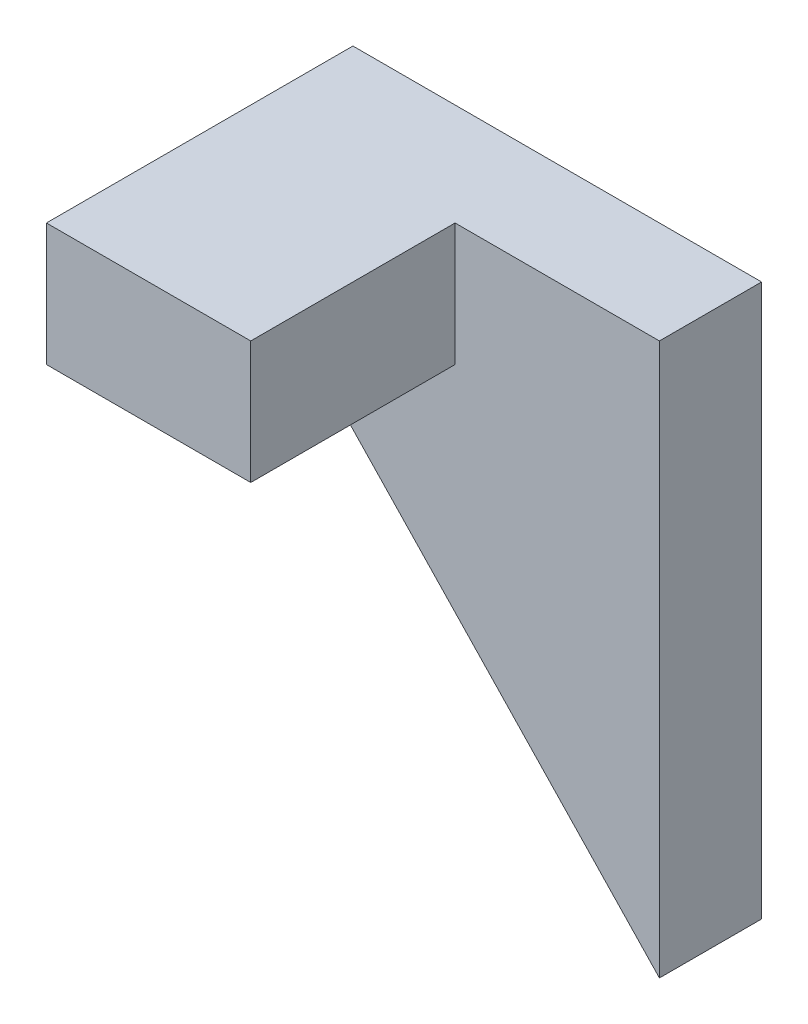
ISO-10303-21;
HEADER;
FILE_DESCRIPTION(('STEP AP214'),'2;1');
FILE_NAME('part.step','',(''),(''),'','','');
FILE_SCHEMA(('AUTOMOTIVE_DESIGN { 1 0 10303 214 1 1 1 1 }'));
ENDSEC;
DATA;
#1=APPLICATION_CONTEXT('core data for automotive mechanical design processes');
#2=APPLICATION_PROTOCOL_DEFINITION('international standard','automotive_design',2000,#1);
#3=PRODUCT_CONTEXT('',#1,'mechanical');
#4=PRODUCT('Part','Part','',(#3));
#5=PRODUCT_RELATED_PRODUCT_CATEGORY('part','',(#4));
#6=PRODUCT_DEFINITION_FORMATION('','',#4);
#7=PRODUCT_DEFINITION_CONTEXT('part definition',#1,'design');
#8=PRODUCT_DEFINITION('design','',#6,#7);
#9=PRODUCT_DEFINITION_SHAPE('','',#8);
#10=(LENGTH_UNIT() NAMED_UNIT(*) SI_UNIT(.MILLI.,.METRE.));
#11=(NAMED_UNIT(*) PLANE_ANGLE_UNIT() SI_UNIT($,.RADIAN.));
#12=(NAMED_UNIT(*) SI_UNIT($,.STERADIAN.) SOLID_ANGLE_UNIT());
#13=UNCERTAINTY_MEASURE_WITH_UNIT(LENGTH_MEASURE(1.E-05),#10,'distance_accuracy_value','');
#14=(GEOMETRIC_REPRESENTATION_CONTEXT(3) GLOBAL_UNCERTAINTY_ASSIGNED_CONTEXT((#13)) GLOBAL_UNIT_ASSIGNED_CONTEXT((#10,
#11,#12)) REPRESENTATION_CONTEXT('',''));
#15=CARTESIAN_POINT('',(0.,0.,0.));
#16=DIRECTION('',(0.,0.,1.));
#17=DIRECTION('',(1.,0.,0.));
#18=AXIS2_PLACEMENT_3D('',#15,#16,#17);
#19=CARTESIAN_POINT('',(-5.99286563614744,-5.70749108204518,10.));
#20=DIRECTION('',(-0.724137931034483,-0.689655172413793,0.));
#21=DIRECTION('',(0.689655172413793,-0.724137931034483,0.));
#22=AXIS2_PLACEMENT_3D('',#19,#20,#21);
#23=PLANE('',#22);
#24=DIRECTION('',(-0.689655172413793,0.724137931034483,0.));
#25=VECTOR('',#24,1.);
#26=CARTESIAN_POINT('',(-5.99286563614744,-5.70749108204518,0.));
#27=LINE('',#26,#25);
#28=CARTESIAN_POINT('',(40.,-54.,0.));
#29=VERTEX_POINT('',#28);
#30=CARTESIAN_POINT('',(0.,-12.,0.));
#31=VERTEX_POINT('',#30);
#32=EDGE_CURVE('E116',#29,#31,#27,.T.);
#33=ORIENTED_EDGE('',*,*,#32,.F.);
#34=DIRECTION('',(0.,0.,-1.));
#35=VECTOR('',#34,1.);
#36=CARTESIAN_POINT('',(40.,-54.,10.));
#37=LINE('',#36,#35);
#38=CARTESIAN_POINT('',(40.,-54.,10.));
#39=VERTEX_POINT('',#38);
#40=EDGE_CURVE('E45',#39,#29,#37,.T.);
#41=ORIENTED_EDGE('',*,*,#40,.F.);
#42=DIRECTION('',(-0.689655172413793,0.724137931034483,0.));
#43=VECTOR('',#42,1.);
#44=CARTESIAN_POINT('',(-5.99286563614744,-5.70749108204518,10.));
#45=LINE('',#44,#43);
#46=CARTESIAN_POINT('',(0.,-12.,10.));
#47=VERTEX_POINT('',#46);
#48=EDGE_CURVE('E129',#39,#47,#45,.T.);
#49=ORIENTED_EDGE('',*,*,#48,.T.);
#50=DIRECTION('',(0.,0.,-1.));
#51=VECTOR('',#50,1.);
#52=CARTESIAN_POINT('',(0.,-12.,10.));
#53=LINE('',#52,#51);
#54=EDGE_CURVE('E11',#47,#31,#53,.T.);
#55=ORIENTED_EDGE('',*,*,#54,.T.);
#56=EDGE_LOOP('',(#33,#41,#49,#55));
#57=FACE_BOUND('',#56,.T.);
#58=ADVANCED_FACE('F37',(#57),#23,.T.);
#59=CARTESIAN_POINT('',(40.,0.,10.));
#60=DIRECTION('',(1.,0.,0.));
#61=DIRECTION('',(0.,1.,0.));
#62=AXIS2_PLACEMENT_3D('',#59,#60,#61);
#63=PLANE('',#62);
#64=DIRECTION('',(0.,-1.,0.));
#65=VECTOR('',#64,1.);
#66=CARTESIAN_POINT('',(40.,0.,0.));
#67=LINE('',#66,#65);
#68=CARTESIAN_POINT('',(40.,0.,0.));
#69=VERTEX_POINT('',#68);
#70=EDGE_CURVE('E119',#69,#29,#67,.T.);
#71=ORIENTED_EDGE('',*,*,#70,.F.);
#72=DIRECTION('',(0.,0.,-1.));
#73=VECTOR('',#72,1.);
#74=CARTESIAN_POINT('',(40.,0.,10.));
#75=LINE('',#74,#73);
#76=CARTESIAN_POINT('',(40.,0.,10.));
#77=VERTEX_POINT('',#76);
#78=EDGE_CURVE('E53',#77,#69,#75,.T.);
#79=ORIENTED_EDGE('',*,*,#78,.F.);
#80=DIRECTION('',(0.,-1.,0.));
#81=VECTOR('',#80,1.);
#82=CARTESIAN_POINT('',(40.,0.,10.));
#83=LINE('',#82,#81);
#84=EDGE_CURVE('E132',#77,#39,#83,.T.);
#85=ORIENTED_EDGE('',*,*,#84,.T.);
#86=ORIENTED_EDGE('',*,*,#40,.T.);
#87=EDGE_LOOP('',(#71,#79,#85,#86));
#88=FACE_BOUND('',#87,.T.);
#89=ADVANCED_FACE('F145',(#88),#63,.T.);
#90=CARTESIAN_POINT('',(0.,0.,10.));
#91=DIRECTION('',(0.,1.,0.));
#92=DIRECTION('',(0.,0.,1.));
#93=AXIS2_PLACEMENT_3D('',#90,#91,#92);
#94=PLANE('',#93);
#95=DIRECTION('',(1.,0.,0.));
#96=VECTOR('',#95,1.);
#97=CARTESIAN_POINT('',(0.,0.,0.));
#98=LINE('',#97,#96);
#99=CARTESIAN_POINT('',(0.,0.,0.));
#100=VERTEX_POINT('',#99);
#101=EDGE_CURVE('E127',#100,#69,#98,.T.);
#102=ORIENTED_EDGE('',*,*,#101,.F.);
#103=DIRECTION('',(0.,0.,-1.));
#104=VECTOR('',#103,1.);
#105=CARTESIAN_POINT('',(0.,0.,30.));
#106=LINE('',#105,#104);
#107=CARTESIAN_POINT('',(0.,0.,30.));
#108=VERTEX_POINT('',#107);
#109=EDGE_CURVE('E121',#108,#100,#106,.T.);
#110=ORIENTED_EDGE('',*,*,#109,.F.);
#111=DIRECTION('',(1.,0.,0.));
#112=VECTOR('',#111,1.);
#113=CARTESIAN_POINT('',(0.,0.,30.));
#114=LINE('',#113,#112);
#115=CARTESIAN_POINT('',(20.,0.,30.));
#116=VERTEX_POINT('',#115);
#117=EDGE_CURVE('E105',#108,#116,#114,.T.);
#118=ORIENTED_EDGE('',*,*,#117,.T.);
#119=DIRECTION('',(0.,0.,-1.));
#120=VECTOR('',#119,1.);
#121=CARTESIAN_POINT('',(20.,0.,30.));
#122=LINE('',#121,#120);
#123=CARTESIAN_POINT('',(20.,0.,10.));
#124=VERTEX_POINT('',#123);
#125=EDGE_CURVE('E101',#116,#124,#122,.T.);
#126=ORIENTED_EDGE('',*,*,#125,.T.);
#127=DIRECTION('',(1.,0.,0.));
#128=VECTOR('',#127,1.);
#129=CARTESIAN_POINT('',(0.,0.,10.));
#130=LINE('',#129,#128);
#131=EDGE_CURVE('E134',#124,#77,#130,.T.);
#132=ORIENTED_EDGE('',*,*,#131,.T.);
#133=ORIENTED_EDGE('',*,*,#78,.T.);
#134=EDGE_LOOP('',(#102,#110,#118,#126,#132,#133));
#135=FACE_BOUND('',#134,.T.);
#136=ADVANCED_FACE('F142',(#135),#94,.T.);
#137=CARTESIAN_POINT('',(0.,0.,10.));
#138=DIRECTION('',(0.,0.,1.));
#139=DIRECTION('',(1.,0.,0.));
#140=AXIS2_PLACEMENT_3D('',#137,#138,#139);
#141=PLANE('',#140);
#142=DIRECTION('',(0.,1.,0.));
#143=VECTOR('',#142,1.);
#144=CARTESIAN_POINT('',(20.,0.,10.));
#145=LINE('',#144,#143);
#146=CARTESIAN_POINT('',(20.,-12.,10.));
#147=VERTEX_POINT('',#146);
#148=EDGE_CURVE('E125',#147,#124,#145,.T.);
#149=ORIENTED_EDGE('',*,*,#148,.F.);
#150=DIRECTION('',(1.,0.,0.));
#151=VECTOR('',#150,1.);
#152=CARTESIAN_POINT('',(0.,-12.,10.));
#153=LINE('',#152,#151);
#154=EDGE_CURVE('E68',#47,#147,#153,.T.);
#155=ORIENTED_EDGE('',*,*,#154,.F.);
#156=ORIENTED_EDGE('',*,*,#48,.F.);
#157=ORIENTED_EDGE('',*,*,#84,.F.);
#158=ORIENTED_EDGE('',*,*,#131,.F.);
#159=EDGE_LOOP('',(#149,#155,#156,#157,#158));
#160=FACE_BOUND('',#159,.T.);
#161=ADVANCED_FACE('F157',(#160),#141,.T.);
#162=CARTESIAN_POINT('',(0.,0.,0.));
#163=DIRECTION('',(0.,0.,1.));
#164=DIRECTION('',(1.,0.,0.));
#165=AXIS2_PLACEMENT_3D('',#162,#163,#164);
#166=PLANE('',#165);
#167=ORIENTED_EDGE('',*,*,#32,.T.);
#168=DIRECTION('',(0.,-1.,0.));
#169=VECTOR('',#168,1.);
#170=CARTESIAN_POINT('',(0.,0.,0.));
#171=LINE('',#170,#169);
#172=EDGE_CURVE('E113',#100,#31,#171,.T.);
#173=ORIENTED_EDGE('',*,*,#172,.F.);
#174=ORIENTED_EDGE('',*,*,#101,.T.);
#175=ORIENTED_EDGE('',*,*,#70,.T.);
#176=EDGE_LOOP('',(#167,#173,#174,#175));
#177=FACE_BOUND('',#176,.T.);
#178=ADVANCED_FACE('F148',(#177),#166,.F.);
#179=CARTESIAN_POINT('',(0.,-12.,30.));
#180=DIRECTION('',(0.,1.,0.));
#181=DIRECTION('',(0.,0.,1.));
#182=AXIS2_PLACEMENT_3D('',#179,#180,#181);
#183=PLANE('',#182);
#184=ORIENTED_EDGE('',*,*,#154,.T.);
#185=DIRECTION('',(0.,0.,-1.));
#186=VECTOR('',#185,1.);
#187=CARTESIAN_POINT('',(20.,-12.,30.));
#188=LINE('',#187,#186);
#189=CARTESIAN_POINT('',(20.,-12.,30.));
#190=VERTEX_POINT('',#189);
#191=EDGE_CURVE('E98',#190,#147,#188,.T.);
#192=ORIENTED_EDGE('',*,*,#191,.F.);
#193=DIRECTION('',(1.,0.,0.));
#194=VECTOR('',#193,1.);
#195=CARTESIAN_POINT('',(0.,-12.,30.));
#196=LINE('',#195,#194);
#197=CARTESIAN_POINT('',(0.,-12.,30.));
#198=VERTEX_POINT('',#197);
#199=EDGE_CURVE('E106',#198,#190,#196,.T.);
#200=ORIENTED_EDGE('',*,*,#199,.F.);
#201=DIRECTION('',(0.,0.,-1.));
#202=VECTOR('',#201,1.);
#203=CARTESIAN_POINT('',(0.,-12.,30.));
#204=LINE('',#203,#202);
#205=EDGE_CURVE('E154',#198,#47,#204,.T.);
#206=ORIENTED_EDGE('',*,*,#205,.T.);
#207=EDGE_LOOP('',(#184,#192,#200,#206));
#208=FACE_BOUND('',#207,.T.);
#209=ADVANCED_FACE('F115',(#208),#183,.F.);
#210=CARTESIAN_POINT('',(20.,0.,30.));
#211=DIRECTION('',(-1.,0.,0.));
#212=DIRECTION('',(0.,0.,1.));
#213=AXIS2_PLACEMENT_3D('',#210,#211,#212);
#214=PLANE('',#213);
#215=ORIENTED_EDGE('',*,*,#148,.T.);
#216=ORIENTED_EDGE('',*,*,#125,.F.);
#217=DIRECTION('',(0.,1.,0.));
#218=VECTOR('',#217,1.);
#219=CARTESIAN_POINT('',(20.,0.,30.));
#220=LINE('',#219,#218);
#221=EDGE_CURVE('E95',#190,#116,#220,.T.);
#222=ORIENTED_EDGE('',*,*,#221,.F.);
#223=ORIENTED_EDGE('',*,*,#191,.T.);
#224=EDGE_LOOP('',(#215,#216,#222,#223));
#225=FACE_BOUND('',#224,.T.);
#226=ADVANCED_FACE('F97',(#225),#214,.F.);
#227=CARTESIAN_POINT('',(0.,0.,30.));
#228=DIRECTION('',(1.,0.,0.));
#229=DIRECTION('',(0.,1.,0.));
#230=AXIS2_PLACEMENT_3D('',#227,#228,#229);
#231=PLANE('',#230);
#232=ORIENTED_EDGE('',*,*,#172,.T.);
#233=ORIENTED_EDGE('',*,*,#54,.F.);
#234=ORIENTED_EDGE('',*,*,#205,.F.);
#235=DIRECTION('',(0.,-1.,0.));
#236=VECTOR('',#235,1.);
#237=CARTESIAN_POINT('',(0.,0.,30.));
#238=LINE('',#237,#236);
#239=EDGE_CURVE('E111',#108,#198,#238,.T.);
#240=ORIENTED_EDGE('',*,*,#239,.F.);
#241=ORIENTED_EDGE('',*,*,#109,.T.);
#242=EDGE_LOOP('',(#232,#233,#234,#240,#241));
#243=FACE_BOUND('',#242,.T.);
#244=ADVANCED_FACE('F155',(#243),#231,.F.);
#245=CARTESIAN_POINT('',(0.,0.,30.));
#246=DIRECTION('',(0.,0.,1.));
#247=DIRECTION('',(1.,0.,0.));
#248=AXIS2_PLACEMENT_3D('',#245,#246,#247);
#249=PLANE('',#248);
#250=ORIENTED_EDGE('',*,*,#199,.T.);
#251=ORIENTED_EDGE('',*,*,#221,.T.);
#252=ORIENTED_EDGE('',*,*,#117,.F.);
#253=ORIENTED_EDGE('',*,*,#239,.T.);
#254=EDGE_LOOP('',(#250,#251,#252,#253));
#255=FACE_BOUND('',#254,.T.);
#256=ADVANCED_FACE('F109',(#255),#249,.T.);
#257=CLOSED_SHELL('',(#58,#89,#136,#161,#178,#209,#226,#244,#256));
#258=MANIFOLD_SOLID_BREP('B2',#257);
#259=ADVANCED_BREP_SHAPE_REPRESENTATION('',(#18,#258),#14);
#260=SHAPE_DEFINITION_REPRESENTATION(#9,#259);
ENDSEC;
END-ISO-10303-21;
